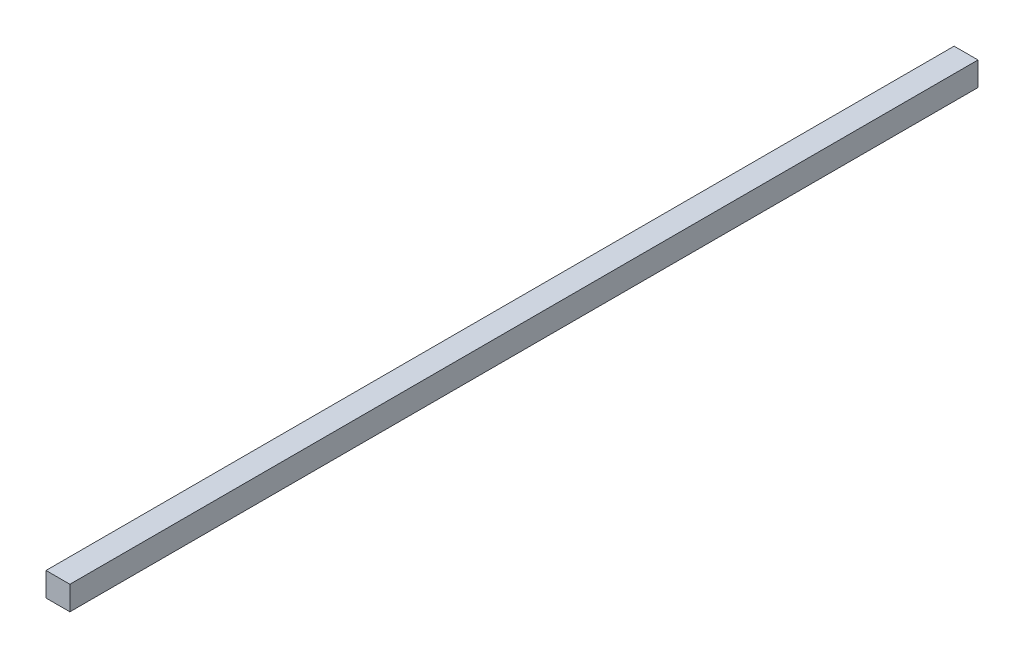
ISO-10303-21;
HEADER;
FILE_DESCRIPTION(('STEP AP214'),'2;1');
FILE_NAME('part.step','',(''),(''),'','','');
FILE_SCHEMA(('AUTOMOTIVE_DESIGN { 1 0 10303 214 1 1 1 1 }'));
ENDSEC;
DATA;
#1=APPLICATION_CONTEXT('core data for automotive mechanical design processes');
#2=APPLICATION_PROTOCOL_DEFINITION('international standard','automotive_design',2000,#1);
#3=PRODUCT_CONTEXT('',#1,'mechanical');
#4=PRODUCT('Part','Part','',(#3));
#5=PRODUCT_RELATED_PRODUCT_CATEGORY('part','',(#4));
#6=PRODUCT_DEFINITION_FORMATION('','',#4);
#7=PRODUCT_DEFINITION_CONTEXT('part definition',#1,'design');
#8=PRODUCT_DEFINITION('design','',#6,#7);
#9=PRODUCT_DEFINITION_SHAPE('','',#8);
#10=(LENGTH_UNIT() NAMED_UNIT(*) SI_UNIT(.MILLI.,.METRE.));
#11=(NAMED_UNIT(*) PLANE_ANGLE_UNIT() SI_UNIT($,.RADIAN.));
#12=(NAMED_UNIT(*) SI_UNIT($,.STERADIAN.) SOLID_ANGLE_UNIT());
#13=UNCERTAINTY_MEASURE_WITH_UNIT(LENGTH_MEASURE(1.E-05),#10,'distance_accuracy_value','');
#14=(GEOMETRIC_REPRESENTATION_CONTEXT(3) GLOBAL_UNCERTAINTY_ASSIGNED_CONTEXT((#13)) GLOBAL_UNIT_ASSIGNED_CONTEXT((#10,
#11,#12)) REPRESENTATION_CONTEXT('',''));
#15=CARTESIAN_POINT('',(0.,0.,0.));
#16=DIRECTION('',(0.,0.,1.));
#17=DIRECTION('',(1.,0.,0.));
#18=AXIS2_PLACEMENT_3D('',#15,#16,#17);
#19=CARTESIAN_POINT('',(5.,-5.,-380.));
#20=DIRECTION('',(1.,0.,0.));
#21=DIRECTION('',(0.,0.,-1.));
#22=AXIS2_PLACEMENT_3D('',#19,#20,#21);
#23=PLANE('',#22);
#24=DIRECTION('',(0.,1.,0.));
#25=VECTOR('',#24,1.);
#26=CARTESIAN_POINT('',(5.,-5.,0.));
#27=LINE('',#26,#25);
#28=CARTESIAN_POINT('',(5.,-5.,0.));
#29=VERTEX_POINT('',#28);
#30=CARTESIAN_POINT('',(5.,5.,0.));
#31=VERTEX_POINT('',#30);
#32=EDGE_CURVE('E97',#29,#31,#27,.T.);
#33=ORIENTED_EDGE('',*,*,#32,.F.);
#34=DIRECTION('',(0.,0.,1.));
#35=VECTOR('',#34,1.);
#36=CARTESIAN_POINT('',(5.,-5.,-380.));
#37=LINE('',#36,#35);
#38=CARTESIAN_POINT('',(5.,-5.,-380.));
#39=VERTEX_POINT('',#38);
#40=EDGE_CURVE('E11',#39,#29,#37,.T.);
#41=ORIENTED_EDGE('',*,*,#40,.F.);
#42=DIRECTION('',(0.,1.,0.));
#43=VECTOR('',#42,1.);
#44=CARTESIAN_POINT('',(5.,-5.,-380.));
#45=LINE('',#44,#43);
#46=CARTESIAN_POINT('',(5.,5.,-380.));
#47=VERTEX_POINT('',#46);
#48=EDGE_CURVE('E91',#39,#47,#45,.T.);
#49=ORIENTED_EDGE('',*,*,#48,.T.);
#50=DIRECTION('',(0.,0.,1.));
#51=VECTOR('',#50,1.);
#52=CARTESIAN_POINT('',(5.,5.,-380.));
#53=LINE('',#52,#51);
#54=EDGE_CURVE('E36',#47,#31,#53,.T.);
#55=ORIENTED_EDGE('',*,*,#54,.T.);
#56=EDGE_LOOP('',(#33,#41,#49,#55));
#57=FACE_BOUND('',#56,.T.);
#58=ADVANCED_FACE('F33',(#57),#23,.T.);
#59=CARTESIAN_POINT('',(-5.,-5.,-380.));
#60=DIRECTION('',(0.,-1.,0.));
#61=DIRECTION('',(0.,0.,-1.));
#62=AXIS2_PLACEMENT_3D('',#59,#60,#61);
#63=PLANE('',#62);
#64=DIRECTION('',(1.,0.,0.));
#65=VECTOR('',#64,1.);
#66=CARTESIAN_POINT('',(-5.,-5.,0.));
#67=LINE('',#66,#65);
#68=CARTESIAN_POINT('',(-5.,-5.,0.));
#69=VERTEX_POINT('',#68);
#70=EDGE_CURVE('E93',#69,#29,#67,.T.);
#71=ORIENTED_EDGE('',*,*,#70,.F.);
#72=DIRECTION('',(0.,0.,1.));
#73=VECTOR('',#72,1.);
#74=CARTESIAN_POINT('',(-5.,-5.,-380.));
#75=LINE('',#74,#73);
#76=CARTESIAN_POINT('',(-5.,-5.,-380.));
#77=VERTEX_POINT('',#76);
#78=EDGE_CURVE('E42',#77,#69,#75,.T.);
#79=ORIENTED_EDGE('',*,*,#78,.F.);
#80=DIRECTION('',(1.,0.,0.));
#81=VECTOR('',#80,1.);
#82=CARTESIAN_POINT('',(-5.,-5.,-380.));
#83=LINE('',#82,#81);
#84=EDGE_CURVE('E88',#77,#39,#83,.T.);
#85=ORIENTED_EDGE('',*,*,#84,.T.);
#86=ORIENTED_EDGE('',*,*,#40,.T.);
#87=EDGE_LOOP('',(#71,#79,#85,#86));
#88=FACE_BOUND('',#87,.T.);
#89=ADVANCED_FACE('F107',(#88),#63,.T.);
#90=CARTESIAN_POINT('',(-5.,-5.,-380.));
#91=DIRECTION('',(-1.,0.,0.));
#92=DIRECTION('',(0.,0.,1.));
#93=AXIS2_PLACEMENT_3D('',#90,#91,#92);
#94=PLANE('',#93);
#95=DIRECTION('',(0.,-1.,0.));
#96=VECTOR('',#95,1.);
#97=CARTESIAN_POINT('',(-5.,-5.,0.));
#98=LINE('',#97,#96);
#99=CARTESIAN_POINT('',(-5.,5.,0.));
#100=VERTEX_POINT('',#99);
#101=EDGE_CURVE('E83',#100,#69,#98,.T.);
#102=ORIENTED_EDGE('',*,*,#101,.F.);
#103=DIRECTION('',(0.,0.,1.));
#104=VECTOR('',#103,1.);
#105=CARTESIAN_POINT('',(-5.,5.,-380.));
#106=LINE('',#105,#104);
#107=CARTESIAN_POINT('',(-5.,5.,-380.));
#108=VERTEX_POINT('',#107);
#109=EDGE_CURVE('E78',#108,#100,#106,.T.);
#110=ORIENTED_EDGE('',*,*,#109,.F.);
#111=DIRECTION('',(0.,-1.,0.));
#112=VECTOR('',#111,1.);
#113=CARTESIAN_POINT('',(-5.,-5.,-380.));
#114=LINE('',#113,#112);
#115=EDGE_CURVE('E81',#108,#77,#114,.T.);
#116=ORIENTED_EDGE('',*,*,#115,.T.);
#117=ORIENTED_EDGE('',*,*,#78,.T.);
#118=EDGE_LOOP('',(#102,#110,#116,#117));
#119=FACE_BOUND('',#118,.T.);
#120=ADVANCED_FACE('F80',(#119),#94,.T.);
#121=CARTESIAN_POINT('',(-5.,5.,-380.));
#122=DIRECTION('',(0.,1.,0.));
#123=DIRECTION('',(0.,0.,1.));
#124=AXIS2_PLACEMENT_3D('',#121,#122,#123);
#125=PLANE('',#124);
#126=DIRECTION('',(-1.,0.,0.));
#127=VECTOR('',#126,1.);
#128=CARTESIAN_POINT('',(-5.,5.,0.));
#129=LINE('',#128,#127);
#130=EDGE_CURVE('E100',#31,#100,#129,.T.);
#131=ORIENTED_EDGE('',*,*,#130,.F.);
#132=ORIENTED_EDGE('',*,*,#54,.F.);
#133=DIRECTION('',(-1.,0.,0.));
#134=VECTOR('',#133,1.);
#135=CARTESIAN_POINT('',(-5.,5.,-380.));
#136=LINE('',#135,#134);
#137=EDGE_CURVE('E87',#47,#108,#136,.T.);
#138=ORIENTED_EDGE('',*,*,#137,.T.);
#139=ORIENTED_EDGE('',*,*,#109,.T.);
#140=EDGE_LOOP('',(#131,#132,#138,#139));
#141=FACE_BOUND('',#140,.T.);
#142=ADVANCED_FACE('F90',(#141),#125,.T.);
#143=CARTESIAN_POINT('',(0.,0.,-380.));
#144=DIRECTION('',(0.,0.,-1.));
#145=DIRECTION('',(-1.,0.,0.));
#146=AXIS2_PLACEMENT_3D('',#143,#144,#145);
#147=PLANE('',#146);
#148=ORIENTED_EDGE('',*,*,#48,.F.);
#149=ORIENTED_EDGE('',*,*,#84,.F.);
#150=ORIENTED_EDGE('',*,*,#115,.F.);
#151=ORIENTED_EDGE('',*,*,#137,.F.);
#152=EDGE_LOOP('',(#148,#149,#150,#151));
#153=FACE_BOUND('',#152,.T.);
#154=ADVANCED_FACE('F86',(#153),#147,.T.);
#155=CARTESIAN_POINT('',(0.,0.,0.));
#156=DIRECTION('',(0.,0.,-1.));
#157=DIRECTION('',(-1.,0.,0.));
#158=AXIS2_PLACEMENT_3D('',#155,#156,#157);
#159=PLANE('',#158);
#160=ORIENTED_EDGE('',*,*,#32,.T.);
#161=ORIENTED_EDGE('',*,*,#130,.T.);
#162=ORIENTED_EDGE('',*,*,#101,.T.);
#163=ORIENTED_EDGE('',*,*,#70,.T.);
#164=EDGE_LOOP('',(#160,#161,#162,#163));
#165=FACE_BOUND('',#164,.T.);
#166=ADVANCED_FACE('F106',(#165),#159,.F.);
#167=CLOSED_SHELL('',(#58,#89,#120,#142,#154,#166));
#168=MANIFOLD_SOLID_BREP('B2',#167);
#169=ADVANCED_BREP_SHAPE_REPRESENTATION('',(#18,#168),#14);
#170=SHAPE_DEFINITION_REPRESENTATION(#9,#169);
ENDSEC;
END-ISO-10303-21;
